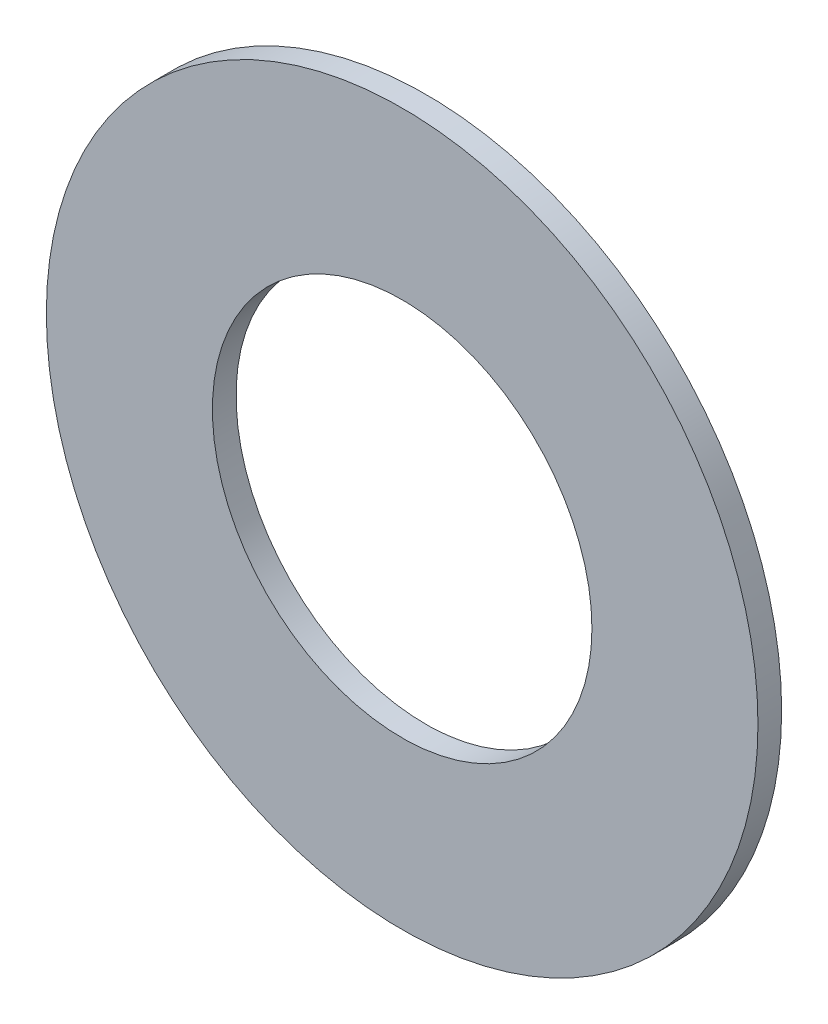
ISO-10303-21;
HEADER;
FILE_DESCRIPTION(('STEP AP214'),'2;1');
FILE_NAME('part.step','',(''),(''),'','','');
FILE_SCHEMA(('AUTOMOTIVE_DESIGN { 1 0 10303 214 1 1 1 1 }'));
ENDSEC;
DATA;
#1=APPLICATION_CONTEXT('core data for automotive mechanical design processes');
#2=APPLICATION_PROTOCOL_DEFINITION('international standard','automotive_design',2000,#1);
#3=PRODUCT_CONTEXT('',#1,'mechanical');
#4=PRODUCT('Part','Part','',(#3));
#5=PRODUCT_RELATED_PRODUCT_CATEGORY('part','',(#4));
#6=PRODUCT_DEFINITION_FORMATION('','',#4);
#7=PRODUCT_DEFINITION_CONTEXT('part definition',#1,'design');
#8=PRODUCT_DEFINITION('design','',#6,#7);
#9=PRODUCT_DEFINITION_SHAPE('','',#8);
#10=(LENGTH_UNIT() NAMED_UNIT(*) SI_UNIT(.MILLI.,.METRE.));
#11=(NAMED_UNIT(*) PLANE_ANGLE_UNIT() SI_UNIT($,.RADIAN.));
#12=(NAMED_UNIT(*) SI_UNIT($,.STERADIAN.) SOLID_ANGLE_UNIT());
#13=UNCERTAINTY_MEASURE_WITH_UNIT(LENGTH_MEASURE(1.E-05),#10,'distance_accuracy_value','');
#14=(GEOMETRIC_REPRESENTATION_CONTEXT(3) GLOBAL_UNCERTAINTY_ASSIGNED_CONTEXT((#13)) GLOBAL_UNIT_ASSIGNED_CONTEXT((#10,
#11,#12)) REPRESENTATION_CONTEXT('',''));
#15=CARTESIAN_POINT('',(0.,0.,0.));
#16=DIRECTION('',(0.,0.,1.));
#17=DIRECTION('',(1.,0.,0.));
#18=AXIS2_PLACEMENT_3D('',#15,#16,#17);
#19=CARTESIAN_POINT('',(0.,0.,0.79248));
#20=DIRECTION('',(0.,0.,-1.));
#21=DIRECTION('',(-1.,0.,0.));
#22=AXIS2_PLACEMENT_3D('',#19,#20,#21);
#23=PLANE('',#22);
#24=CARTESIAN_POINT('',(0.,0.,0.79248));
#25=DIRECTION('',(0.,0.,1.));
#26=DIRECTION('',(1.,0.,0.));
#27=AXIS2_PLACEMENT_3D('',#24,#25,#26);
#28=CIRCLE('',#27,6.35);
#29=CARTESIAN_POINT('',(6.35,0.,0.79248));
#30=VERTEX_POINT('',#29);
#31=EDGE_CURVE('E27',#30,#30,#28,.F.);
#32=ORIENTED_EDGE('',*,*,#31,.T.);
#33=EDGE_LOOP('',(#32));
#34=FACE_BOUND('',#33,.T.);
#35=CARTESIAN_POINT('',(0.,0.,0.79248));
#36=DIRECTION('',(0.,0.,1.));
#37=DIRECTION('',(1.,0.,0.));
#38=AXIS2_PLACEMENT_3D('',#35,#36,#37);
#39=CIRCLE('',#38,11.90625);
#40=CARTESIAN_POINT('',(11.90625,0.,0.79248));
#41=VERTEX_POINT('',#40);
#42=EDGE_CURVE('E18',#41,#41,#39,.F.);
#43=ORIENTED_EDGE('',*,*,#42,.F.);
#44=EDGE_LOOP('',(#43));
#45=FACE_BOUND('',#44,.T.);
#46=ADVANCED_FACE('F15',(#34,#45),#23,.F.);
#47=CARTESIAN_POINT('',(0.,0.,0.));
#48=DIRECTION('',(0.,0.,1.));
#49=DIRECTION('',(1.,0.,0.));
#50=AXIS2_PLACEMENT_3D('',#47,#48,#49);
#51=CYLINDRICAL_SURFACE('',#50,11.90625);
#52=CARTESIAN_POINT('',(0.,0.,0.));
#53=DIRECTION('',(0.,0.,1.));
#54=DIRECTION('',(1.,0.,0.));
#55=AXIS2_PLACEMENT_3D('',#52,#53,#54);
#56=CIRCLE('',#55,11.90625);
#57=CARTESIAN_POINT('',(11.90625,0.,0.));
#58=VERTEX_POINT('',#57);
#59=EDGE_CURVE('E22',#58,#58,#56,.F.);
#60=ORIENTED_EDGE('',*,*,#59,.F.);
#61=EDGE_LOOP('',(#60));
#62=FACE_BOUND('',#61,.T.);
#63=ORIENTED_EDGE('',*,*,#42,.T.);
#64=EDGE_LOOP('',(#63));
#65=FACE_BOUND('',#64,.T.);
#66=ADVANCED_FACE('F35',(#62,#65),#51,.T.);
#67=CARTESIAN_POINT('',(0.,0.,0.));
#68=DIRECTION('',(0.,0.,1.));
#69=DIRECTION('',(1.,0.,0.));
#70=AXIS2_PLACEMENT_3D('',#67,#68,#69);
#71=CYLINDRICAL_SURFACE('',#70,6.35);
#72=CARTESIAN_POINT('',(0.,0.,0.));
#73=DIRECTION('',(0.,0.,1.));
#74=DIRECTION('',(1.,0.,0.));
#75=AXIS2_PLACEMENT_3D('',#72,#73,#74);
#76=CIRCLE('',#75,6.35);
#77=CARTESIAN_POINT('',(6.35,0.,0.));
#78=VERTEX_POINT('',#77);
#79=EDGE_CURVE('E10',#78,#78,#76,.T.);
#80=ORIENTED_EDGE('',*,*,#79,.F.);
#81=EDGE_LOOP('',(#80));
#82=FACE_BOUND('',#81,.T.);
#83=ORIENTED_EDGE('',*,*,#31,.F.);
#84=EDGE_LOOP('',(#83));
#85=FACE_BOUND('',#84,.T.);
#86=ADVANCED_FACE('F42',(#82,#85),#71,.F.);
#87=CARTESIAN_POINT('',(0.,0.,0.));
#88=DIRECTION('',(0.,0.,-1.));
#89=DIRECTION('',(-1.,0.,0.));
#90=AXIS2_PLACEMENT_3D('',#87,#88,#89);
#91=PLANE('',#90);
#92=ORIENTED_EDGE('',*,*,#79,.T.);
#93=EDGE_LOOP('',(#92));
#94=FACE_BOUND('',#93,.T.);
#95=ORIENTED_EDGE('',*,*,#59,.T.);
#96=EDGE_LOOP('',(#95));
#97=FACE_BOUND('',#96,.T.);
#98=ADVANCED_FACE('F44',(#94,#97),#91,.T.);
#99=CLOSED_SHELL('',(#46,#66,#86,#98));
#100=MANIFOLD_SOLID_BREP('B1',#99);
#101=ADVANCED_BREP_SHAPE_REPRESENTATION('',(#18,#100),#14);
#102=SHAPE_DEFINITION_REPRESENTATION(#9,#101);
ENDSEC;
END-ISO-10303-21;
